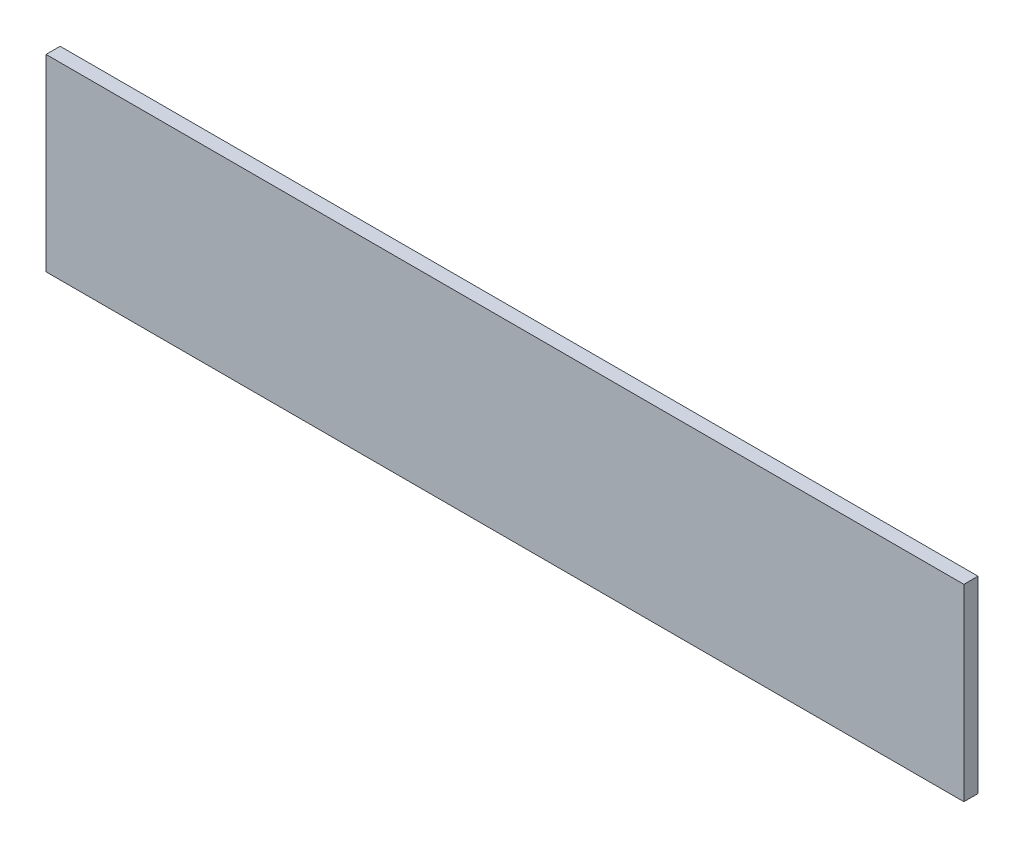
ISO-10303-21;
HEADER;
FILE_DESCRIPTION(('STEP AP214'),'2;1');
FILE_NAME('part.step','',(''),(''),'','','');
FILE_SCHEMA(('AUTOMOTIVE_DESIGN { 1 0 10303 214 1 1 1 1 }'));
ENDSEC;
DATA;
#1=APPLICATION_CONTEXT('core data for automotive mechanical design processes');
#2=APPLICATION_PROTOCOL_DEFINITION('international standard','automotive_design',2000,#1);
#3=PRODUCT_CONTEXT('',#1,'mechanical');
#4=PRODUCT('Part','Part','',(#3));
#5=PRODUCT_RELATED_PRODUCT_CATEGORY('part','',(#4));
#6=PRODUCT_DEFINITION_FORMATION('','',#4);
#7=PRODUCT_DEFINITION_CONTEXT('part definition',#1,'design');
#8=PRODUCT_DEFINITION('design','',#6,#7);
#9=PRODUCT_DEFINITION_SHAPE('','',#8);
#10=(LENGTH_UNIT() NAMED_UNIT(*) SI_UNIT(.MILLI.,.METRE.));
#11=(NAMED_UNIT(*) PLANE_ANGLE_UNIT() SI_UNIT($,.RADIAN.));
#12=(NAMED_UNIT(*) SI_UNIT($,.STERADIAN.) SOLID_ANGLE_UNIT());
#13=UNCERTAINTY_MEASURE_WITH_UNIT(LENGTH_MEASURE(1.E-05),#10,'distance_accuracy_value','');
#14=(GEOMETRIC_REPRESENTATION_CONTEXT(3) GLOBAL_UNCERTAINTY_ASSIGNED_CONTEXT((#13)) GLOBAL_UNIT_ASSIGNED_CONTEXT((#10,
#11,#12)) REPRESENTATION_CONTEXT('',''));
#15=CARTESIAN_POINT('',(0.,0.,0.));
#16=DIRECTION('',(0.,0.,1.));
#17=DIRECTION('',(1.,0.,0.));
#18=AXIS2_PLACEMENT_3D('',#15,#16,#17);
#19=CARTESIAN_POINT('',(-134.139791906406,32.1106060606061,3.));
#20=DIRECTION('',(1.,0.,0.));
#21=DIRECTION('',(0.,0.,-1.));
#22=AXIS2_PLACEMENT_3D('',#19,#20,#21);
#23=PLANE('',#22);
#24=DIRECTION('',(0.,-1.,0.));
#25=VECTOR('',#24,1.);
#26=CARTESIAN_POINT('',(-134.139791906406,32.1106060606061,0.));
#27=LINE('',#26,#25);
#28=CARTESIAN_POINT('',(-134.139791906406,32.1106060606061,0.));
#29=VERTEX_POINT('',#28);
#30=CARTESIAN_POINT('',(-134.139791906406,-7.88939393939393,0.));
#31=VERTEX_POINT('',#30);
#32=EDGE_CURVE('E96',#29,#31,#27,.T.);
#33=ORIENTED_EDGE('',*,*,#32,.T.);
#34=DIRECTION('',(0.,0.,-1.));
#35=VECTOR('',#34,1.);
#36=CARTESIAN_POINT('',(-134.139791906406,-7.88939393939393,3.));
#37=LINE('',#36,#35);
#38=CARTESIAN_POINT('',(-134.139791906406,-7.88939393939393,3.));
#39=VERTEX_POINT('',#38);
#40=EDGE_CURVE('E11',#39,#31,#37,.T.);
#41=ORIENTED_EDGE('',*,*,#40,.F.);
#42=DIRECTION('',(0.,-1.,0.));
#43=VECTOR('',#42,1.);
#44=CARTESIAN_POINT('',(-134.139791906406,32.1106060606061,3.));
#45=LINE('',#44,#43);
#46=CARTESIAN_POINT('',(-134.139791906406,32.1106060606061,3.));
#47=VERTEX_POINT('',#46);
#48=EDGE_CURVE('E84',#47,#39,#45,.T.);
#49=ORIENTED_EDGE('',*,*,#48,.F.);
#50=DIRECTION('',(0.,0.,-1.));
#51=VECTOR('',#50,1.);
#52=CARTESIAN_POINT('',(-134.139791906406,32.1106060606061,3.));
#53=LINE('',#52,#51);
#54=EDGE_CURVE('E92',#47,#29,#53,.T.);
#55=ORIENTED_EDGE('',*,*,#54,.T.);
#56=EDGE_LOOP('',(#33,#41,#49,#55));
#57=FACE_BOUND('',#56,.T.);
#58=ADVANCED_FACE('F33',(#57),#23,.F.);
#59=CARTESIAN_POINT('',(-134.139791906406,-7.88939393939393,3.));
#60=DIRECTION('',(0.,1.,0.));
#61=DIRECTION('',(0.,0.,1.));
#62=AXIS2_PLACEMENT_3D('',#59,#60,#61);
#63=PLANE('',#62);
#64=DIRECTION('',(1.,0.,0.));
#65=VECTOR('',#64,1.);
#66=CARTESIAN_POINT('',(-134.139791906406,-7.88939393939393,0.));
#67=LINE('',#66,#65);
#68=CARTESIAN_POINT('',(60.8602080935942,-7.88939393939393,0.));
#69=VERTEX_POINT('',#68);
#70=EDGE_CURVE('E88',#31,#69,#67,.T.);
#71=ORIENTED_EDGE('',*,*,#70,.T.);
#72=DIRECTION('',(0.,0.,-1.));
#73=VECTOR('',#72,1.);
#74=CARTESIAN_POINT('',(60.8602080935942,-7.88939393939393,3.));
#75=LINE('',#74,#73);
#76=CARTESIAN_POINT('',(60.8602080935942,-7.88939393939393,3.));
#77=VERTEX_POINT('',#76);
#78=EDGE_CURVE('E41',#77,#69,#75,.T.);
#79=ORIENTED_EDGE('',*,*,#78,.F.);
#80=DIRECTION('',(1.,0.,0.));
#81=VECTOR('',#80,1.);
#82=CARTESIAN_POINT('',(-134.139791906406,-7.88939393939393,3.));
#83=LINE('',#82,#81);
#84=EDGE_CURVE('E79',#39,#77,#83,.T.);
#85=ORIENTED_EDGE('',*,*,#84,.F.);
#86=ORIENTED_EDGE('',*,*,#40,.T.);
#87=EDGE_LOOP('',(#71,#79,#85,#86));
#88=FACE_BOUND('',#87,.T.);
#89=ADVANCED_FACE('F87',(#88),#63,.F.);
#90=CARTESIAN_POINT('',(60.8602080935942,32.1106060606061,3.));
#91=DIRECTION('',(-1.,0.,0.));
#92=DIRECTION('',(0.,0.,1.));
#93=AXIS2_PLACEMENT_3D('',#90,#91,#92);
#94=PLANE('',#93);
#95=DIRECTION('',(0.,1.,0.));
#96=VECTOR('',#95,1.);
#97=CARTESIAN_POINT('',(60.8602080935942,32.1106060606061,0.));
#98=LINE('',#97,#96);
#99=CARTESIAN_POINT('',(60.8602080935942,32.1106060606061,0.));
#100=VERTEX_POINT('',#99);
#101=EDGE_CURVE('E66',#69,#100,#98,.T.);
#102=ORIENTED_EDGE('',*,*,#101,.T.);
#103=DIRECTION('',(0.,0.,-1.));
#104=VECTOR('',#103,1.);
#105=CARTESIAN_POINT('',(60.8602080935942,32.1106060606061,3.));
#106=LINE('',#105,#104);
#107=CARTESIAN_POINT('',(60.8602080935942,32.1106060606061,3.));
#108=VERTEX_POINT('',#107);
#109=EDGE_CURVE('E89',#108,#100,#106,.T.);
#110=ORIENTED_EDGE('',*,*,#109,.F.);
#111=DIRECTION('',(0.,1.,0.));
#112=VECTOR('',#111,1.);
#113=CARTESIAN_POINT('',(60.8602080935942,32.1106060606061,3.));
#114=LINE('',#113,#112);
#115=EDGE_CURVE('E82',#77,#108,#114,.T.);
#116=ORIENTED_EDGE('',*,*,#115,.F.);
#117=ORIENTED_EDGE('',*,*,#78,.T.);
#118=EDGE_LOOP('',(#102,#110,#116,#117));
#119=FACE_BOUND('',#118,.T.);
#120=ADVANCED_FACE('F90',(#119),#94,.F.);
#121=CARTESIAN_POINT('',(-134.139791906406,32.1106060606061,3.));
#122=DIRECTION('',(0.,-1.,0.));
#123=DIRECTION('',(0.,0.,-1.));
#124=AXIS2_PLACEMENT_3D('',#121,#122,#123);
#125=PLANE('',#124);
#126=DIRECTION('',(-1.,0.,0.));
#127=VECTOR('',#126,1.);
#128=CARTESIAN_POINT('',(-134.139791906406,32.1106060606061,0.));
#129=LINE('',#128,#127);
#130=EDGE_CURVE('E72',#100,#29,#129,.T.);
#131=ORIENTED_EDGE('',*,*,#130,.T.);
#132=ORIENTED_EDGE('',*,*,#54,.F.);
#133=DIRECTION('',(-1.,0.,0.));
#134=VECTOR('',#133,1.);
#135=CARTESIAN_POINT('',(-134.139791906406,32.1106060606061,3.));
#136=LINE('',#135,#134);
#137=EDGE_CURVE('E49',#108,#47,#136,.T.);
#138=ORIENTED_EDGE('',*,*,#137,.F.);
#139=ORIENTED_EDGE('',*,*,#109,.T.);
#140=EDGE_LOOP('',(#131,#132,#138,#139));
#141=FACE_BOUND('',#140,.T.);
#142=ADVANCED_FACE('F103',(#141),#125,.F.);
#143=CARTESIAN_POINT('',(0.,0.,3.));
#144=DIRECTION('',(0.,0.,1.));
#145=DIRECTION('',(1.,0.,0.));
#146=AXIS2_PLACEMENT_3D('',#143,#144,#145);
#147=PLANE('',#146);
#148=ORIENTED_EDGE('',*,*,#48,.T.);
#149=ORIENTED_EDGE('',*,*,#84,.T.);
#150=ORIENTED_EDGE('',*,*,#115,.T.);
#151=ORIENTED_EDGE('',*,*,#137,.T.);
#152=EDGE_LOOP('',(#148,#149,#150,#151));
#153=FACE_BOUND('',#152,.T.);
#154=ADVANCED_FACE('F80',(#153),#147,.T.);
#155=CARTESIAN_POINT('',(0.,0.,0.));
#156=DIRECTION('',(0.,0.,1.));
#157=DIRECTION('',(1.,0.,0.));
#158=AXIS2_PLACEMENT_3D('',#155,#156,#157);
#159=PLANE('',#158);
#160=ORIENTED_EDGE('',*,*,#32,.F.);
#161=ORIENTED_EDGE('',*,*,#130,.F.);
#162=ORIENTED_EDGE('',*,*,#101,.F.);
#163=ORIENTED_EDGE('',*,*,#70,.F.);
#164=EDGE_LOOP('',(#160,#161,#162,#163));
#165=FACE_BOUND('',#164,.T.);
#166=ADVANCED_FACE('F106',(#165),#159,.F.);
#167=CLOSED_SHELL('',(#58,#89,#120,#142,#154,#166));
#168=MANIFOLD_SOLID_BREP('B2',#167);
#169=ADVANCED_BREP_SHAPE_REPRESENTATION('',(#18,#168),#14);
#170=SHAPE_DEFINITION_REPRESENTATION(#9,#169);
ENDSEC;
END-ISO-10303-21;
